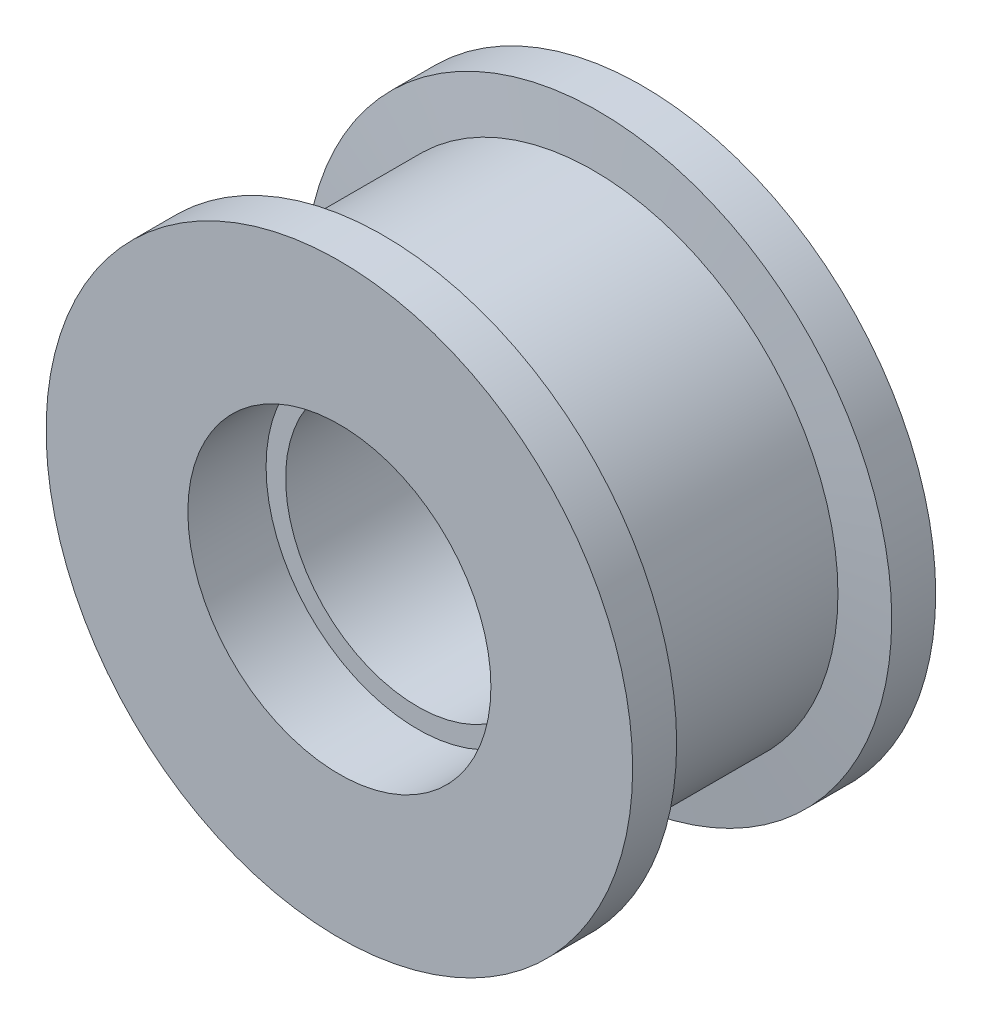
ISO-10303-21;
HEADER;
FILE_DESCRIPTION(('STEP AP214'),'2;1');
FILE_NAME('part.step','',(''),(''),'','','');
FILE_SCHEMA(('AUTOMOTIVE_DESIGN { 1 0 10303 214 1 1 1 1 }'));
ENDSEC;
DATA;
#1=APPLICATION_CONTEXT('core data for automotive mechanical design processes');
#2=APPLICATION_PROTOCOL_DEFINITION('international standard','automotive_design',2000,#1);
#3=PRODUCT_CONTEXT('',#1,'mechanical');
#4=PRODUCT('Part','Part','',(#3));
#5=PRODUCT_RELATED_PRODUCT_CATEGORY('part','',(#4));
#6=PRODUCT_DEFINITION_FORMATION('','',#4);
#7=PRODUCT_DEFINITION_CONTEXT('part definition',#1,'design');
#8=PRODUCT_DEFINITION('design','',#6,#7);
#9=PRODUCT_DEFINITION_SHAPE('','',#8);
#10=(LENGTH_UNIT() NAMED_UNIT(*) SI_UNIT(.MILLI.,.METRE.));
#11=(NAMED_UNIT(*) PLANE_ANGLE_UNIT() SI_UNIT($,.RADIAN.));
#12=(NAMED_UNIT(*) SI_UNIT($,.STERADIAN.) SOLID_ANGLE_UNIT());
#13=UNCERTAINTY_MEASURE_WITH_UNIT(LENGTH_MEASURE(1.E-05),#10,'distance_accuracy_value','');
#14=(GEOMETRIC_REPRESENTATION_CONTEXT(3) GLOBAL_UNCERTAINTY_ASSIGNED_CONTEXT((#13)) GLOBAL_UNIT_ASSIGNED_CONTEXT((#10,
#11,#12)) REPRESENTATION_CONTEXT('',''));
#15=CARTESIAN_POINT('',(0.,0.,0.));
#16=DIRECTION('',(0.,0.,1.));
#17=DIRECTION('',(1.,0.,0.));
#18=AXIS2_PLACEMENT_3D('',#15,#16,#17);
#19=CARTESIAN_POINT('',(0.,-7444.98323822232,4202.91524097881));
#20=DIRECTION('',(0.,0.,1.));
#21=DIRECTION('',(1.,0.,0.));
#22=AXIS2_PLACEMENT_3D('',#19,#20,#21);
#23=PLANE('',#22);
#24=CARTESIAN_POINT('',(0.,-7413.98323822232,4202.91524097881));
#25=DIRECTION('',(0.,0.,1.));
#26=DIRECTION('',(1.,0.,0.));
#27=AXIS2_PLACEMENT_3D('',#24,#25,#26);
#28=CIRCLE('',#27,59.9999999999996);
#29=CARTESIAN_POINT('',(59.9999999999996,-7413.98323822232,4202.91524097881));
#30=VERTEX_POINT('',#29);
#31=EDGE_CURVE('E10',#30,#30,#28,.T.);
#32=ORIENTED_EDGE('',*,*,#31,.T.);
#33=EDGE_LOOP('',(#32));
#34=FACE_BOUND('',#33,.T.);
#35=CARTESIAN_POINT('',(0.,-7413.98323822232,4202.91524097881));
#36=DIRECTION('',(0.,0.,1.));
#37=DIRECTION('',(1.,0.,0.));
#38=AXIS2_PLACEMENT_3D('',#35,#36,#37);
#39=CIRCLE('',#38,30.9999999999997);
#40=CARTESIAN_POINT('',(30.9999999999997,-7413.98323822232,4202.91524097881));
#41=VERTEX_POINT('',#40);
#42=EDGE_CURVE('E70',#41,#41,#39,.T.);
#43=ORIENTED_EDGE('',*,*,#42,.F.);
#44=EDGE_LOOP('',(#43));
#45=FACE_BOUND('',#44,.T.);
#46=ADVANCED_FACE('F30',(#34,#45),#23,.T.);
#47=CARTESIAN_POINT('',(0.,-7413.98323822232,4235.17838032797));
#48=DIRECTION('',(0.,0.,1.));
#49=DIRECTION('',(1.,0.,0.));
#50=AXIS2_PLACEMENT_3D('',#47,#48,#49);
#51=CYLINDRICAL_SURFACE('',#50,60.0000000000001);
#52=CARTESIAN_POINT('',(0.,-7413.98323822232,4193.91524097881));
#53=DIRECTION('',(0.,0.,1.));
#54=DIRECTION('',(1.,0.,0.));
#55=AXIS2_PLACEMENT_3D('',#52,#53,#54);
#56=CIRCLE('',#55,60.0000000000005);
#57=CARTESIAN_POINT('',(60.0000000000005,-7413.98323822232,4193.91524097881));
#58=VERTEX_POINT('',#57);
#59=EDGE_CURVE('E36',#58,#58,#56,.T.);
#60=ORIENTED_EDGE('',*,*,#59,.T.);
#61=EDGE_LOOP('',(#60));
#62=FACE_BOUND('',#61,.T.);
#63=ORIENTED_EDGE('',*,*,#31,.F.);
#64=EDGE_LOOP('',(#63));
#65=FACE_BOUND('',#64,.T.);
#66=ADVANCED_FACE('F78',(#62,#65),#51,.T.);
#67=CARTESIAN_POINT('',(0.,-7413.98323822232,4193.91524097881));
#68=DIRECTION('',(0.,0.,1.));
#69=DIRECTION('',(1.,0.,0.));
#70=AXIS2_PLACEMENT_3D('',#67,#68,#69);
#71=CONICAL_SURFACE('',#70,60.0000000000005,1.4711276743038);
#72=CARTESIAN_POINT('',(0.,-7413.98323822232,4192.91524097881));
#73=DIRECTION('',(0.,0.,1.));
#74=DIRECTION('',(1.,0.,0.));
#75=AXIS2_PLACEMENT_3D('',#72,#73,#74);
#76=CIRCLE('',#75,49.9999999999998);
#77=CARTESIAN_POINT('',(49.9999999999998,-7413.98323822232,4192.91524097881));
#78=VERTEX_POINT('',#77);
#79=EDGE_CURVE('E40',#78,#78,#76,.T.);
#80=ORIENTED_EDGE('',*,*,#79,.T.);
#81=EDGE_LOOP('',(#80));
#82=FACE_BOUND('',#81,.T.);
#83=ORIENTED_EDGE('',*,*,#59,.F.);
#84=EDGE_LOOP('',(#83));
#85=FACE_BOUND('',#84,.T.);
#86=ADVANCED_FACE('F82',(#82,#85),#71,.T.);
#87=CARTESIAN_POINT('',(0.,-7413.98323822232,4235.17838032797));
#88=DIRECTION('',(0.,0.,1.));
#89=DIRECTION('',(1.,0.,0.));
#90=AXIS2_PLACEMENT_3D('',#87,#88,#89);
#91=CYLINDRICAL_SURFACE('',#90,50.0000000000003);
#92=CARTESIAN_POINT('',(0.,-7413.98323822232,4150.91524097881));
#93=DIRECTION('',(0.,0.,1.));
#94=DIRECTION('',(1.,0.,0.));
#95=AXIS2_PLACEMENT_3D('',#92,#93,#94);
#96=CIRCLE('',#95,50.0000000000007);
#97=CARTESIAN_POINT('',(50.0000000000007,-7413.98323822232,4150.91524097881));
#98=VERTEX_POINT('',#97);
#99=EDGE_CURVE('E44',#98,#98,#96,.T.);
#100=ORIENTED_EDGE('',*,*,#99,.T.);
#101=EDGE_LOOP('',(#100));
#102=FACE_BOUND('',#101,.T.);
#103=ORIENTED_EDGE('',*,*,#79,.F.);
#104=EDGE_LOOP('',(#103));
#105=FACE_BOUND('',#104,.T.);
#106=ADVANCED_FACE('F86',(#102,#105),#91,.T.);
#107=CARTESIAN_POINT('',(0.,-7413.98323822232,4150.91524097881));
#108=DIRECTION('',(0.,0.,-1.));
#109=DIRECTION('',(-1.,0.,0.));
#110=AXIS2_PLACEMENT_3D('',#107,#108,#109);
#111=CONICAL_SURFACE('',#110,50.0000000000007,1.47112767430379);
#112=CARTESIAN_POINT('',(0.,-7413.98323822232,4149.91524097881));
#113=DIRECTION('',(0.,0.,1.));
#114=DIRECTION('',(1.,0.,0.));
#115=AXIS2_PLACEMENT_3D('',#112,#113,#114);
#116=CIRCLE('',#115,60.0000000000005);
#117=CARTESIAN_POINT('',(60.0000000000005,-7413.98323822232,4149.91524097881));
#118=VERTEX_POINT('',#117);
#119=EDGE_CURVE('E49',#118,#118,#116,.T.);
#120=ORIENTED_EDGE('',*,*,#119,.T.);
#121=EDGE_LOOP('',(#120));
#122=FACE_BOUND('',#121,.T.);
#123=ORIENTED_EDGE('',*,*,#99,.F.);
#124=EDGE_LOOP('',(#123));
#125=FACE_BOUND('',#124,.T.);
#126=ADVANCED_FACE('F93',(#122,#125),#111,.T.);
#127=CARTESIAN_POINT('',(0.,-7413.98323822232,4235.17838032797));
#128=DIRECTION('',(0.,0.,1.));
#129=DIRECTION('',(1.,0.,0.));
#130=AXIS2_PLACEMENT_3D('',#127,#128,#129);
#131=CYLINDRICAL_SURFACE('',#130,60.0000000000001);
#132=CARTESIAN_POINT('',(0.,-7413.98323822232,4140.91524097881));
#133=DIRECTION('',(0.,0.,1.));
#134=DIRECTION('',(1.,0.,0.));
#135=AXIS2_PLACEMENT_3D('',#132,#133,#134);
#136=CIRCLE('',#135,59.9999999999996);
#137=CARTESIAN_POINT('',(59.9999999999996,-7413.98323822232,4140.91524097881));
#138=VERTEX_POINT('',#137);
#139=EDGE_CURVE('E52',#138,#138,#136,.T.);
#140=ORIENTED_EDGE('',*,*,#139,.T.);
#141=EDGE_LOOP('',(#140));
#142=FACE_BOUND('',#141,.T.);
#143=ORIENTED_EDGE('',*,*,#119,.F.);
#144=EDGE_LOOP('',(#143));
#145=FACE_BOUND('',#144,.T.);
#146=ADVANCED_FACE('F97',(#142,#145),#131,.T.);
#147=CARTESIAN_POINT('',(0.,-7473.98323822232,4140.91524097881));
#148=DIRECTION('',(0.,0.,-1.));
#149=DIRECTION('',(-1.,0.,0.));
#150=AXIS2_PLACEMENT_3D('',#147,#148,#149);
#151=PLANE('',#150);
#152=CARTESIAN_POINT('',(0.,-7413.98323822232,4140.91524097881));
#153=DIRECTION('',(0.,0.,1.));
#154=DIRECTION('',(1.,0.,0.));
#155=AXIS2_PLACEMENT_3D('',#152,#153,#154);
#156=CIRCLE('',#155,30.9999999999997);
#157=CARTESIAN_POINT('',(30.9999999999997,-7413.98323822232,4140.91524097881));
#158=VERTEX_POINT('',#157);
#159=EDGE_CURVE('E55',#158,#158,#156,.T.);
#160=ORIENTED_EDGE('',*,*,#159,.T.);
#161=EDGE_LOOP('',(#160));
#162=FACE_BOUND('',#161,.T.);
#163=ORIENTED_EDGE('',*,*,#139,.F.);
#164=EDGE_LOOP('',(#163));
#165=FACE_BOUND('',#164,.T.);
#166=ADVANCED_FACE('F101',(#162,#165),#151,.T.);
#167=CARTESIAN_POINT('',(0.,-7413.98323822232,4235.17838032797));
#168=DIRECTION('',(0.,0.,1.));
#169=DIRECTION('',(1.,0.,0.));
#170=AXIS2_PLACEMENT_3D('',#167,#168,#169);
#171=CYLINDRICAL_SURFACE('',#170,30.9999999999993);
#172=CARTESIAN_POINT('',(0.,-7413.98323822232,4156.91524097881));
#173=DIRECTION('',(0.,0.,1.));
#174=DIRECTION('',(1.,0.,0.));
#175=AXIS2_PLACEMENT_3D('',#172,#173,#174);
#176=CIRCLE('',#175,30.9999999999988);
#177=CARTESIAN_POINT('',(30.9999999999988,-7413.98323822232,4156.91524097881));
#178=VERTEX_POINT('',#177);
#179=EDGE_CURVE('E58',#178,#178,#176,.T.);
#180=ORIENTED_EDGE('',*,*,#179,.T.);
#181=EDGE_LOOP('',(#180));
#182=FACE_BOUND('',#181,.T.);
#183=ORIENTED_EDGE('',*,*,#159,.F.);
#184=EDGE_LOOP('',(#183));
#185=FACE_BOUND('',#184,.T.);
#186=ADVANCED_FACE('F105',(#182,#185),#171,.F.);
#187=CARTESIAN_POINT('',(0.,-7444.98323822232,4156.91524097881));
#188=DIRECTION('',(0.,0.,-1.));
#189=DIRECTION('',(-1.,0.,0.));
#190=AXIS2_PLACEMENT_3D('',#187,#188,#189);
#191=PLANE('',#190);
#192=CARTESIAN_POINT('',(0.,-7413.98323822232,4156.91524097881));
#193=DIRECTION('',(0.,0.,1.));
#194=DIRECTION('',(1.,0.,0.));
#195=AXIS2_PLACEMENT_3D('',#192,#193,#194);
#196=CIRCLE('',#195,27.0000000000001);
#197=CARTESIAN_POINT('',(27.0000000000001,-7413.98323822232,4156.91524097881));
#198=VERTEX_POINT('',#197);
#199=EDGE_CURVE('E61',#198,#198,#196,.T.);
#200=ORIENTED_EDGE('',*,*,#199,.T.);
#201=EDGE_LOOP('',(#200));
#202=FACE_BOUND('',#201,.T.);
#203=ORIENTED_EDGE('',*,*,#179,.F.);
#204=EDGE_LOOP('',(#203));
#205=FACE_BOUND('',#204,.T.);
#206=ADVANCED_FACE('F109',(#202,#205),#191,.T.);
#207=CARTESIAN_POINT('',(0.,-7413.98323822232,4235.17838032797));
#208=DIRECTION('',(0.,0.,1.));
#209=DIRECTION('',(1.,0.,0.));
#210=AXIS2_PLACEMENT_3D('',#207,#208,#209);
#211=CYLINDRICAL_SURFACE('',#210,27.0000000000001);
#212=CARTESIAN_POINT('',(0.,-7413.98323822232,4186.91524097881));
#213=DIRECTION('',(0.,0.,1.));
#214=DIRECTION('',(1.,0.,0.));
#215=AXIS2_PLACEMENT_3D('',#212,#213,#214);
#216=CIRCLE('',#215,27.0000000000001);
#217=CARTESIAN_POINT('',(27.0000000000001,-7413.98323822232,4186.91524097881));
#218=VERTEX_POINT('',#217);
#219=EDGE_CURVE('E64',#218,#218,#216,.T.);
#220=ORIENTED_EDGE('',*,*,#219,.T.);
#221=EDGE_LOOP('',(#220));
#222=FACE_BOUND('',#221,.T.);
#223=ORIENTED_EDGE('',*,*,#199,.F.);
#224=EDGE_LOOP('',(#223));
#225=FACE_BOUND('',#224,.T.);
#226=ADVANCED_FACE('F113',(#222,#225),#211,.F.);
#227=CARTESIAN_POINT('',(0.,-7440.98323822232,4186.91524097881));
#228=DIRECTION('',(0.,0.,1.));
#229=DIRECTION('',(1.,0.,0.));
#230=AXIS2_PLACEMENT_3D('',#227,#228,#229);
#231=PLANE('',#230);
#232=CARTESIAN_POINT('',(0.,-7413.98323822232,4186.91524097881));
#233=DIRECTION('',(0.,0.,1.));
#234=DIRECTION('',(1.,0.,0.));
#235=AXIS2_PLACEMENT_3D('',#232,#233,#234);
#236=CIRCLE('',#235,30.9999999999997);
#237=CARTESIAN_POINT('',(30.9999999999997,-7413.98323822232,4186.91524097881));
#238=VERTEX_POINT('',#237);
#239=EDGE_CURVE('E67',#238,#238,#236,.T.);
#240=ORIENTED_EDGE('',*,*,#239,.T.);
#241=EDGE_LOOP('',(#240));
#242=FACE_BOUND('',#241,.T.);
#243=ORIENTED_EDGE('',*,*,#219,.F.);
#244=EDGE_LOOP('',(#243));
#245=FACE_BOUND('',#244,.T.);
#246=ADVANCED_FACE('F117',(#242,#245),#231,.T.);
#247=CARTESIAN_POINT('',(0.,-7413.98323822232,4235.17838032797));
#248=DIRECTION('',(0.,0.,1.));
#249=DIRECTION('',(1.,0.,0.));
#250=AXIS2_PLACEMENT_3D('',#247,#248,#249);
#251=CYLINDRICAL_SURFACE('',#250,30.9999999999997);
#252=ORIENTED_EDGE('',*,*,#42,.T.);
#253=EDGE_LOOP('',(#252));
#254=FACE_BOUND('',#253,.T.);
#255=ORIENTED_EDGE('',*,*,#239,.F.);
#256=EDGE_LOOP('',(#255));
#257=FACE_BOUND('',#256,.T.);
#258=ADVANCED_FACE('F74',(#254,#257),#251,.F.);
#259=CLOSED_SHELL('',(#46,#66,#86,#106,#126,#146,#166,#186,#206,#226,#246,#258));
#260=MANIFOLD_SOLID_BREP('B2',#259);
#261=ADVANCED_BREP_SHAPE_REPRESENTATION('',(#18,#260),#14);
#262=SHAPE_DEFINITION_REPRESENTATION(#9,#261);
ENDSEC;
END-ISO-10303-21;
